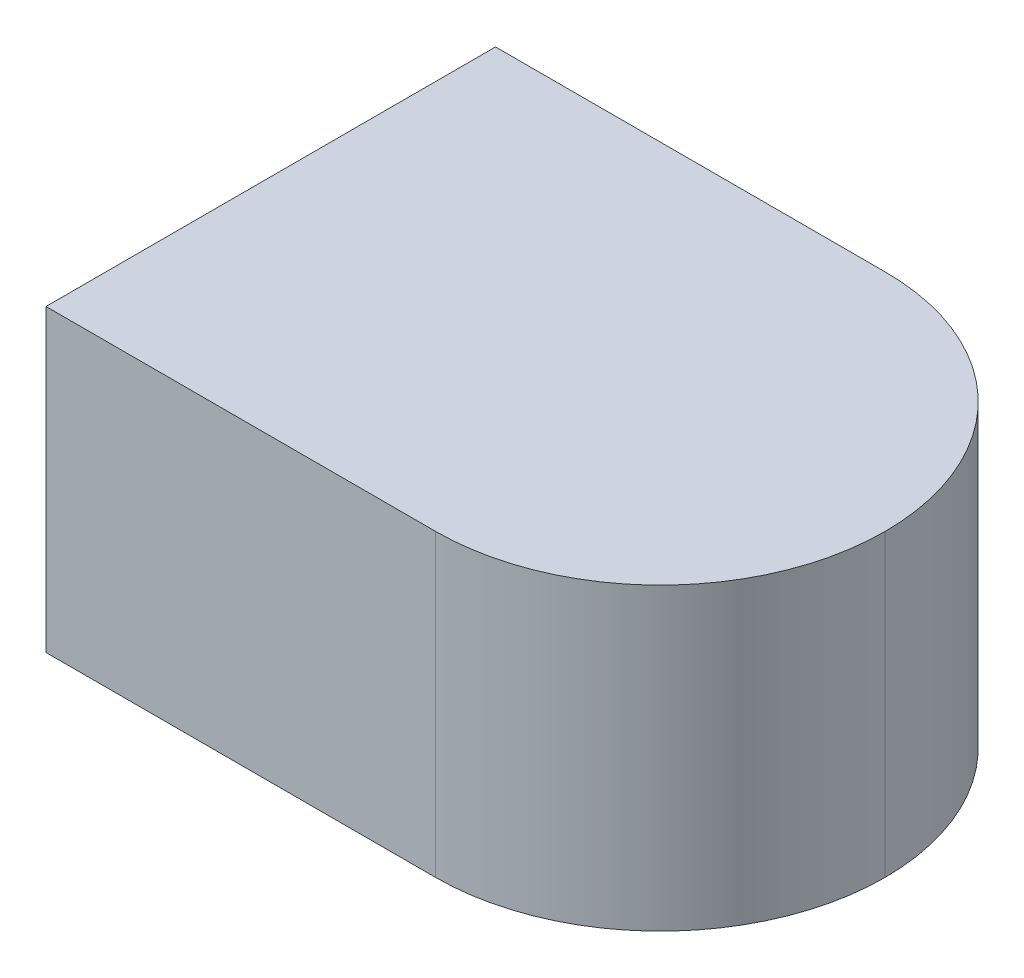
ISO-10303-21;
HEADER;
FILE_DESCRIPTION(('STEP AP214'),'2;1');
FILE_NAME('part.step','',(''),(''),'','','');
FILE_SCHEMA(('AUTOMOTIVE_DESIGN { 1 0 10303 214 1 1 1 1 }'));
ENDSEC;
DATA;
#1=APPLICATION_CONTEXT('core data for automotive mechanical design processes');
#2=APPLICATION_PROTOCOL_DEFINITION('international standard','automotive_design',2000,#1);
#3=PRODUCT_CONTEXT('',#1,'mechanical');
#4=PRODUCT('Part','Part','',(#3));
#5=PRODUCT_RELATED_PRODUCT_CATEGORY('part','',(#4));
#6=PRODUCT_DEFINITION_FORMATION('','',#4);
#7=PRODUCT_DEFINITION_CONTEXT('part definition',#1,'design');
#8=PRODUCT_DEFINITION('design','',#6,#7);
#9=PRODUCT_DEFINITION_SHAPE('','',#8);
#10=(LENGTH_UNIT() NAMED_UNIT(*) SI_UNIT(.MILLI.,.METRE.));
#11=(NAMED_UNIT(*) PLANE_ANGLE_UNIT() SI_UNIT($,.RADIAN.));
#12=(NAMED_UNIT(*) SI_UNIT($,.STERADIAN.) SOLID_ANGLE_UNIT());
#13=UNCERTAINTY_MEASURE_WITH_UNIT(LENGTH_MEASURE(1.E-05),#10,'distance_accuracy_value','');
#14=(GEOMETRIC_REPRESENTATION_CONTEXT(3) GLOBAL_UNCERTAINTY_ASSIGNED_CONTEXT((#13)) GLOBAL_UNIT_ASSIGNED_CONTEXT((#10,
#11,#12)) REPRESENTATION_CONTEXT('',''));
#15=CARTESIAN_POINT('',(0.,0.,0.));
#16=DIRECTION('',(0.,0.,1.));
#17=DIRECTION('',(1.,0.,0.));
#18=AXIS2_PLACEMENT_3D('',#15,#16,#17);
#19=CARTESIAN_POINT('',(-0.205,0.2,-0.15));
#20=DIRECTION('',(0.,0.,1.));
#21=DIRECTION('',(1.,0.,0.));
#22=AXIS2_PLACEMENT_3D('',#19,#20,#21);
#23=PLANE('',#22);
#24=DIRECTION('',(-1.,0.,0.));
#25=VECTOR('',#24,1.);
#26=CARTESIAN_POINT('',(-0.205,0.2,-0.15));
#27=LINE('',#26,#25);
#28=CARTESIAN_POINT('',(0.0550000000000001,0.2,-0.15));
#29=VERTEX_POINT('',#28);
#30=CARTESIAN_POINT('',(-0.205,0.2,-0.15));
#31=VERTEX_POINT('',#30);
#32=EDGE_CURVE('E83',#29,#31,#27,.T.);
#33=ORIENTED_EDGE('',*,*,#32,.F.);
#34=DIRECTION('',(0.,-1.,0.));
#35=VECTOR('',#34,1.);
#36=CARTESIAN_POINT('',(0.0550000000000001,0.2,-0.15));
#37=LINE('',#36,#35);
#38=CARTESIAN_POINT('',(0.0550000000000001,0.,-0.15));
#39=VERTEX_POINT('',#38);
#40=EDGE_CURVE('E101',#29,#39,#37,.T.);
#41=ORIENTED_EDGE('',*,*,#40,.T.);
#42=DIRECTION('',(-1.,0.,0.));
#43=VECTOR('',#42,1.);
#44=CARTESIAN_POINT('',(-0.205,0.,-0.15));
#45=LINE('',#44,#43);
#46=CARTESIAN_POINT('',(-0.205,0.,-0.15));
#47=VERTEX_POINT('',#46);
#48=EDGE_CURVE('E98',#39,#47,#45,.T.);
#49=ORIENTED_EDGE('',*,*,#48,.T.);
#50=DIRECTION('',(0.,-1.,0.));
#51=VECTOR('',#50,1.);
#52=CARTESIAN_POINT('',(-0.205,0.2,-0.15));
#53=LINE('',#52,#51);
#54=EDGE_CURVE('E96',#31,#47,#53,.T.);
#55=ORIENTED_EDGE('',*,*,#54,.F.);
#56=EDGE_LOOP('',(#33,#41,#49,#55));
#57=FACE_BOUND('',#56,.T.);
#58=ADVANCED_FACE('F37',(#57),#23,.F.);
#59=CARTESIAN_POINT('',(-0.205,0.2,0.15));
#60=DIRECTION('',(1.,0.,0.));
#61=DIRECTION('',(0.,0.,-1.));
#62=AXIS2_PLACEMENT_3D('',#59,#60,#61);
#63=PLANE('',#62);
#64=DIRECTION('',(0.,0.,1.));
#65=VECTOR('',#64,1.);
#66=CARTESIAN_POINT('',(-0.205,0.,0.15));
#67=LINE('',#66,#65);
#68=CARTESIAN_POINT('',(-0.205,0.,0.15));
#69=VERTEX_POINT('',#68);
#70=EDGE_CURVE('E111',#47,#69,#67,.T.);
#71=ORIENTED_EDGE('',*,*,#70,.T.);
#72=DIRECTION('',(0.,-1.,0.));
#73=VECTOR('',#72,1.);
#74=CARTESIAN_POINT('',(-0.205,0.2,0.15));
#75=LINE('',#74,#73);
#76=CARTESIAN_POINT('',(-0.205,0.2,0.15));
#77=VERTEX_POINT('',#76);
#78=EDGE_CURVE('E102',#77,#69,#75,.T.);
#79=ORIENTED_EDGE('',*,*,#78,.F.);
#80=DIRECTION('',(0.,0.,1.));
#81=VECTOR('',#80,1.);
#82=CARTESIAN_POINT('',(-0.205,0.2,0.15));
#83=LINE('',#82,#81);
#84=EDGE_CURVE('E87',#31,#77,#83,.T.);
#85=ORIENTED_EDGE('',*,*,#84,.F.);
#86=ORIENTED_EDGE('',*,*,#54,.T.);
#87=EDGE_LOOP('',(#71,#79,#85,#86));
#88=FACE_BOUND('',#87,.T.);
#89=ADVANCED_FACE('F104',(#88),#63,.F.);
#90=CARTESIAN_POINT('',(-0.205,0.2,0.15));
#91=DIRECTION('',(0.,0.,-1.));
#92=DIRECTION('',(-1.,0.,0.));
#93=AXIS2_PLACEMENT_3D('',#90,#91,#92);
#94=PLANE('',#93);
#95=DIRECTION('',(1.,0.,0.));
#96=VECTOR('',#95,1.);
#97=CARTESIAN_POINT('',(-0.205,0.,0.15));
#98=LINE('',#97,#96);
#99=CARTESIAN_POINT('',(0.0550000000000001,0.,0.15));
#100=VERTEX_POINT('',#99);
#101=EDGE_CURVE('E93',#69,#100,#98,.T.);
#102=ORIENTED_EDGE('',*,*,#101,.T.);
#103=DIRECTION('',(0.,-1.,0.));
#104=VECTOR('',#103,1.);
#105=CARTESIAN_POINT('',(0.0550000000000001,0.2,0.15));
#106=LINE('',#105,#104);
#107=CARTESIAN_POINT('',(0.0550000000000001,0.2,0.15));
#108=VERTEX_POINT('',#107);
#109=EDGE_CURVE('E11',#100,#108,#106,.F.);
#110=ORIENTED_EDGE('',*,*,#109,.T.);
#111=DIRECTION('',(1.,0.,0.));
#112=VECTOR('',#111,1.);
#113=CARTESIAN_POINT('',(-0.205,0.2,0.15));
#114=LINE('',#113,#112);
#115=EDGE_CURVE('E106',#77,#108,#114,.T.);
#116=ORIENTED_EDGE('',*,*,#115,.F.);
#117=ORIENTED_EDGE('',*,*,#78,.T.);
#118=EDGE_LOOP('',(#102,#110,#116,#117));
#119=FACE_BOUND('',#118,.T.);
#120=ADVANCED_FACE('F138',(#119),#94,.F.);
#121=CARTESIAN_POINT('',(0.,0.2,0.));
#122=DIRECTION('',(0.,-1.,0.));
#123=DIRECTION('',(0.,0.,-1.));
#124=AXIS2_PLACEMENT_3D('',#121,#122,#123);
#125=PLANE('',#124);
#126=CARTESIAN_POINT('',(0.055,0.2,0.));
#127=DIRECTION('',(0.,-1.,0.));
#128=DIRECTION('',(0.,0.,-1.));
#129=AXIS2_PLACEMENT_3D('',#126,#127,#128);
#130=CIRCLE('',#129,0.15);
#131=CARTESIAN_POINT('',(0.205,0.2,0.));
#132=VERTEX_POINT('',#131);
#133=EDGE_CURVE('E58',#108,#132,#130,.F.);
#134=ORIENTED_EDGE('',*,*,#133,.T.);
#135=CARTESIAN_POINT('',(0.0550000000000001,0.2,0.));
#136=DIRECTION('',(0.,-1.,0.));
#137=DIRECTION('',(0.,0.,-1.));
#138=AXIS2_PLACEMENT_3D('',#135,#136,#137);
#139=CIRCLE('',#138,0.15);
#140=EDGE_CURVE('E46',#132,#29,#139,.F.);
#141=ORIENTED_EDGE('',*,*,#140,.T.);
#142=ORIENTED_EDGE('',*,*,#32,.T.);
#143=ORIENTED_EDGE('',*,*,#84,.T.);
#144=ORIENTED_EDGE('',*,*,#115,.T.);
#145=EDGE_LOOP('',(#134,#141,#142,#143,#144));
#146=FACE_BOUND('',#145,.T.);
#147=ADVANCED_FACE('F85',(#146),#125,.F.);
#148=CARTESIAN_POINT('',(0.,0.,0.));
#149=DIRECTION('',(0.,-1.,0.));
#150=DIRECTION('',(0.,0.,-1.));
#151=AXIS2_PLACEMENT_3D('',#148,#149,#150);
#152=PLANE('',#151);
#153=ORIENTED_EDGE('',*,*,#48,.F.);
#154=CARTESIAN_POINT('',(0.0550000000000001,0.,0.));
#155=DIRECTION('',(0.,-1.,0.));
#156=DIRECTION('',(0.,0.,-1.));
#157=AXIS2_PLACEMENT_3D('',#154,#155,#156);
#158=CIRCLE('',#157,0.15);
#159=CARTESIAN_POINT('',(0.205,0.,0.));
#160=VERTEX_POINT('',#159);
#161=EDGE_CURVE('E118',#39,#160,#158,.T.);
#162=ORIENTED_EDGE('',*,*,#161,.T.);
#163=CARTESIAN_POINT('',(0.055,0.,0.));
#164=DIRECTION('',(0.,-1.,0.));
#165=DIRECTION('',(0.,0.,-1.));
#166=AXIS2_PLACEMENT_3D('',#163,#164,#165);
#167=CIRCLE('',#166,0.15);
#168=EDGE_CURVE('E116',#160,#100,#167,.T.);
#169=ORIENTED_EDGE('',*,*,#168,.T.);
#170=ORIENTED_EDGE('',*,*,#101,.F.);
#171=ORIENTED_EDGE('',*,*,#70,.F.);
#172=EDGE_LOOP('',(#153,#162,#169,#170,#171));
#173=FACE_BOUND('',#172,.T.);
#174=ADVANCED_FACE('F123',(#173),#152,.T.);
#175=CARTESIAN_POINT('',(0.055,0.2,0.));
#176=DIRECTION('',(0.,-1.,0.));
#177=DIRECTION('',(0.,0.,-1.));
#178=AXIS2_PLACEMENT_3D('',#175,#176,#177);
#179=CYLINDRICAL_SURFACE('',#178,0.15);
#180=DIRECTION('',(0.,-1.,0.));
#181=VECTOR('',#180,1.);
#182=CARTESIAN_POINT('',(0.205,0.2,0.));
#183=LINE('',#182,#181);
#184=EDGE_CURVE('E41',#132,#160,#183,.T.);
#185=ORIENTED_EDGE('',*,*,#184,.F.);
#186=ORIENTED_EDGE('',*,*,#133,.F.);
#187=ORIENTED_EDGE('',*,*,#109,.F.);
#188=ORIENTED_EDGE('',*,*,#168,.F.);
#189=EDGE_LOOP('',(#185,#186,#187,#188));
#190=FACE_BOUND('',#189,.T.);
#191=ADVANCED_FACE('F39',(#190),#179,.T.);
#192=CARTESIAN_POINT('',(0.0550000000000001,0.2,0.));
#193=DIRECTION('',(0.,-1.,0.));
#194=DIRECTION('',(0.,0.,-1.));
#195=AXIS2_PLACEMENT_3D('',#192,#193,#194);
#196=CYLINDRICAL_SURFACE('',#195,0.15);
#197=ORIENTED_EDGE('',*,*,#140,.F.);
#198=ORIENTED_EDGE('',*,*,#184,.T.);
#199=ORIENTED_EDGE('',*,*,#161,.F.);
#200=ORIENTED_EDGE('',*,*,#40,.F.);
#201=EDGE_LOOP('',(#197,#198,#199,#200));
#202=FACE_BOUND('',#201,.T.);
#203=ADVANCED_FACE('F128',(#202),#196,.T.);
#204=CLOSED_SHELL('',(#58,#89,#120,#147,#174,#191,#203));
#205=MANIFOLD_SOLID_BREP('B2',#204);
#206=ADVANCED_BREP_SHAPE_REPRESENTATION('',(#18,#205),#14);
#207=SHAPE_DEFINITION_REPRESENTATION(#9,#206);
ENDSEC;
END-ISO-10303-21;
